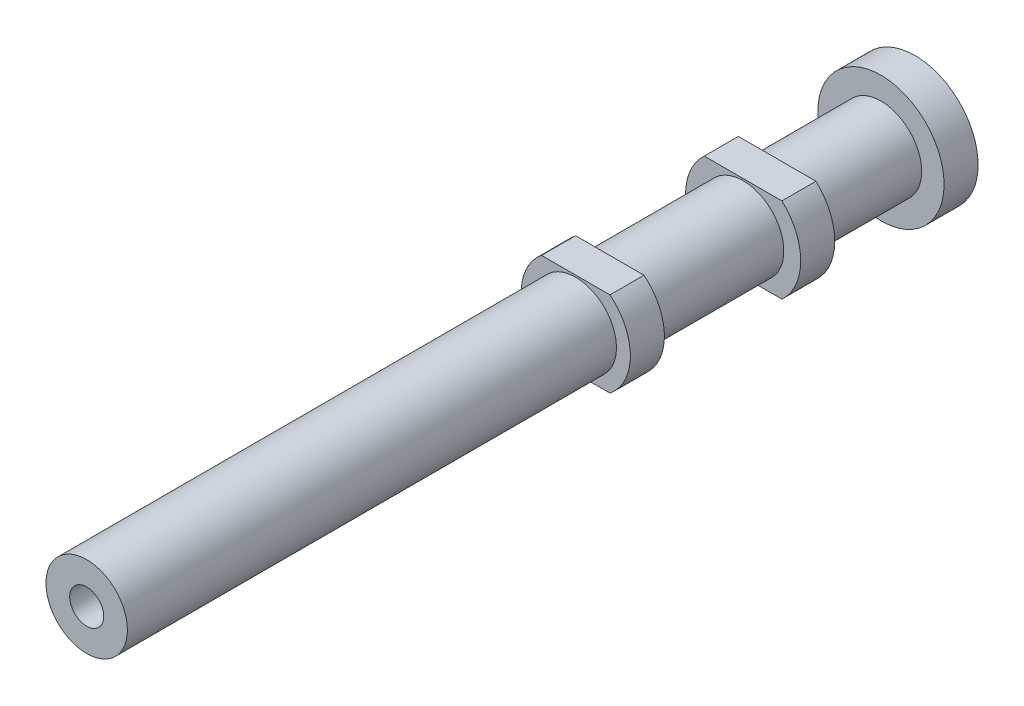
ISO-10303-21;
HEADER;
FILE_DESCRIPTION(('STEP AP214'),'2;1');
FILE_NAME('part.step','',(''),(''),'','','');
FILE_SCHEMA(('AUTOMOTIVE_DESIGN { 1 0 10303 214 1 1 1 1 }'));
ENDSEC;
DATA;
#1=APPLICATION_CONTEXT('core data for automotive mechanical design processes');
#2=APPLICATION_PROTOCOL_DEFINITION('international standard','automotive_design',2000,#1);
#3=PRODUCT_CONTEXT('',#1,'mechanical');
#4=PRODUCT('Part','Part','',(#3));
#5=PRODUCT_RELATED_PRODUCT_CATEGORY('part','',(#4));
#6=PRODUCT_DEFINITION_FORMATION('','',#4);
#7=PRODUCT_DEFINITION_CONTEXT('part definition',#1,'design');
#8=PRODUCT_DEFINITION('design','',#6,#7);
#9=PRODUCT_DEFINITION_SHAPE('','',#8);
#10=(LENGTH_UNIT() NAMED_UNIT(*) SI_UNIT(.MILLI.,.METRE.));
#11=(NAMED_UNIT(*) PLANE_ANGLE_UNIT() SI_UNIT($,.RADIAN.));
#12=(NAMED_UNIT(*) SI_UNIT($,.STERADIAN.) SOLID_ANGLE_UNIT());
#13=UNCERTAINTY_MEASURE_WITH_UNIT(LENGTH_MEASURE(1.E-05),#10,'distance_accuracy_value','');
#14=(GEOMETRIC_REPRESENTATION_CONTEXT(3) GLOBAL_UNCERTAINTY_ASSIGNED_CONTEXT((#13)) GLOBAL_UNIT_ASSIGNED_CONTEXT((#10,
#11,#12)) REPRESENTATION_CONTEXT('',''));
#15=CARTESIAN_POINT('',(0.,0.,0.));
#16=DIRECTION('',(0.,0.,1.));
#17=DIRECTION('',(1.,0.,0.));
#18=AXIS2_PLACEMENT_3D('',#15,#16,#17);
#19=CARTESIAN_POINT('',(0.,0.,-14.6));
#20=DIRECTION('',(0.,0.,-1.));
#21=DIRECTION('',(-1.,0.,0.));
#22=AXIS2_PLACEMENT_3D('',#19,#20,#21);
#23=CYLINDRICAL_SURFACE('',#22,1.925);
#24=CARTESIAN_POINT('',(0.,0.,-2.64));
#25=DIRECTION('',(0.,0.,-1.));
#26=DIRECTION('',(-1.,0.,0.));
#27=AXIS2_PLACEMENT_3D('',#24,#25,#26);
#28=CIRCLE('',#27,1.925);
#29=CARTESIAN_POINT('',(-1.20649285120139,-1.50000000000006,-2.64));
#30=VERTEX_POINT('',#29);
#31=CARTESIAN_POINT('',(-1.20649285120139,1.50000000000006,-2.64));
#32=VERTEX_POINT('',#31);
#33=EDGE_CURVE('E141',#30,#32,#28,.T.);
#34=ORIENTED_EDGE('',*,*,#33,.T.);
#35=DIRECTION('',(0.,0.,-1.));
#36=VECTOR('',#35,1.);
#37=CARTESIAN_POINT('',(-1.20649285120128,1.49999999999983,-14.6));
#38=LINE('',#37,#36);
#39=CARTESIAN_POINT('',(-1.20649285120139,1.50000000000006,-3.84));
#40=VERTEX_POINT('',#39);
#41=EDGE_CURVE('E67',#32,#40,#38,.T.);
#42=ORIENTED_EDGE('',*,*,#41,.T.);
#43=CARTESIAN_POINT('',(0.,0.,-3.84));
#44=DIRECTION('',(0.,0.,-1.));
#45=DIRECTION('',(-1.,0.,0.));
#46=AXIS2_PLACEMENT_3D('',#43,#44,#45);
#47=CIRCLE('',#46,1.925);
#48=CARTESIAN_POINT('',(-1.20649285120139,-1.50000000000006,-3.84));
#49=VERTEX_POINT('',#48);
#50=EDGE_CURVE('E151',#49,#40,#47,.T.);
#51=ORIENTED_EDGE('',*,*,#50,.F.);
#52=DIRECTION('',(0.,0.,-1.));
#53=VECTOR('',#52,1.);
#54=CARTESIAN_POINT('',(-1.20649285120139,-1.50000000000006,-14.6));
#55=LINE('',#54,#53);
#56=EDGE_CURVE('E295',#49,#30,#55,.F.);
#57=ORIENTED_EDGE('',*,*,#56,.T.);
#58=EDGE_LOOP('',(#34,#42,#51,#57));
#59=FACE_BOUND('',#58,.T.);
#60=ADVANCED_FACE('F43',(#59),#23,.T.);
#61=CARTESIAN_POINT('',(0.,0.,-14.6));
#62=DIRECTION('',(0.,0.,-1.));
#63=DIRECTION('',(-1.,0.,0.));
#64=AXIS2_PLACEMENT_3D('',#61,#62,#63);
#65=CYLINDRICAL_SURFACE('',#64,2.03);
#66=CARTESIAN_POINT('',(0.,0.,-8.54));
#67=DIRECTION('',(0.,0.,-1.));
#68=DIRECTION('',(-1.,0.,0.));
#69=AXIS2_PLACEMENT_3D('',#66,#67,#68);
#70=CIRCLE('',#69,2.03);
#71=CARTESIAN_POINT('',(-1.36780846612378,-1.50000000000028,-8.54));
#72=VERTEX_POINT('',#71);
#73=CARTESIAN_POINT('',(-1.36780846612383,1.49999999999983,-8.54000000000001));
#74=VERTEX_POINT('',#73);
#75=EDGE_CURVE('E143',#72,#74,#70,.T.);
#76=ORIENTED_EDGE('',*,*,#75,.T.);
#77=DIRECTION('',(0.,0.,-1.));
#78=VECTOR('',#77,1.);
#79=CARTESIAN_POINT('',(-1.36780846612378,1.49999999999983,-14.6));
#80=LINE('',#79,#78);
#81=CARTESIAN_POINT('',(-1.36780846612383,1.49999999999983,-9.74000000000001));
#82=VERTEX_POINT('',#81);
#83=EDGE_CURVE('E134',#74,#82,#80,.T.);
#84=ORIENTED_EDGE('',*,*,#83,.T.);
#85=CARTESIAN_POINT('',(0.,0.,-9.74));
#86=DIRECTION('',(0.,0.,-1.));
#87=DIRECTION('',(-1.,0.,0.));
#88=AXIS2_PLACEMENT_3D('',#85,#86,#87);
#89=CIRCLE('',#88,2.03);
#90=CARTESIAN_POINT('',(-1.36780846612378,-1.50000000000028,-9.74));
#91=VERTEX_POINT('',#90);
#92=EDGE_CURVE('E127',#91,#82,#89,.T.);
#93=ORIENTED_EDGE('',*,*,#92,.F.);
#94=DIRECTION('',(0.,0.,-1.));
#95=VECTOR('',#94,1.);
#96=CARTESIAN_POINT('',(-1.36780846612378,-1.50000000000028,-14.6));
#97=LINE('',#96,#95);
#98=EDGE_CURVE('E108',#91,#72,#97,.F.);
#99=ORIENTED_EDGE('',*,*,#98,.T.);
#100=EDGE_LOOP('',(#76,#84,#93,#99));
#101=FACE_BOUND('',#100,.T.);
#102=ADVANCED_FACE('F133',(#101),#65,.T.);
#103=CARTESIAN_POINT('',(0.,0.,14.6));
#104=DIRECTION('',(0.,0.,-1.));
#105=DIRECTION('',(-1.,0.,0.));
#106=AXIS2_PLACEMENT_3D('',#103,#104,#105);
#107=CYLINDRICAL_SURFACE('',#106,1.435);
#108=CARTESIAN_POINT('',(0.,0.,-9.74));
#109=DIRECTION('',(0.,0.,1.));
#110=DIRECTION('',(1.,0.,0.));
#111=AXIS2_PLACEMENT_3D('',#108,#109,#110);
#112=CIRCLE('',#111,1.435);
#113=CARTESIAN_POINT('',(1.435,0.,-9.74));
#114=VERTEX_POINT('',#113);
#115=EDGE_CURVE('E180',#114,#114,#112,.T.);
#116=ORIENTED_EDGE('',*,*,#115,.F.);
#117=EDGE_LOOP('',(#116));
#118=FACE_BOUND('',#117,.T.);
#119=CARTESIAN_POINT('',(0.,0.,-13.4));
#120=DIRECTION('',(0.,0.,-1.));
#121=DIRECTION('',(-1.,0.,0.));
#122=AXIS2_PLACEMENT_3D('',#119,#120,#121);
#123=CIRCLE('',#122,1.435);
#124=CARTESIAN_POINT('',(-1.435,0.,-13.4));
#125=VERTEX_POINT('',#124);
#126=EDGE_CURVE('E184',#125,#125,#123,.T.);
#127=ORIENTED_EDGE('',*,*,#126,.F.);
#128=EDGE_LOOP('',(#127));
#129=FACE_BOUND('',#128,.T.);
#130=ADVANCED_FACE('F45',(#118,#129),#107,.T.);
#131=CARTESIAN_POINT('',(0.,0.,-3.84));
#132=DIRECTION('',(0.,0.,1.));
#133=DIRECTION('',(1.,0.,0.));
#134=AXIS2_PLACEMENT_3D('',#131,#132,#133);
#135=CIRCLE('',#134,1.435);
#136=CARTESIAN_POINT('',(1.435,0.,-3.84));
#137=VERTEX_POINT('',#136);
#138=EDGE_CURVE('E172',#137,#137,#135,.T.);
#139=ORIENTED_EDGE('',*,*,#138,.F.);
#140=EDGE_LOOP('',(#139));
#141=FACE_BOUND('',#140,.T.);
#142=CARTESIAN_POINT('',(0.,0.,-8.54));
#143=DIRECTION('',(0.,0.,-1.));
#144=DIRECTION('',(-1.,0.,0.));
#145=AXIS2_PLACEMENT_3D('',#142,#143,#144);
#146=CIRCLE('',#145,1.435);
#147=CARTESIAN_POINT('',(-1.435,0.,-8.54));
#148=VERTEX_POINT('',#147);
#149=EDGE_CURVE('E176',#148,#148,#146,.T.);
#150=ORIENTED_EDGE('',*,*,#149,.F.);
#151=EDGE_LOOP('',(#150));
#152=FACE_BOUND('',#151,.T.);
#153=ADVANCED_FACE('F243',(#141,#152),#107,.T.);
#154=CARTESIAN_POINT('',(0.,0.,14.6));
#155=DIRECTION('',(0.,0.,1.));
#156=DIRECTION('',(1.,0.,0.));
#157=AXIS2_PLACEMENT_3D('',#154,#155,#156);
#158=CIRCLE('',#157,1.435);
#159=CARTESIAN_POINT('',(1.435,0.,14.6));
#160=VERTEX_POINT('',#159);
#161=EDGE_CURVE('E160',#160,#160,#158,.T.);
#162=ORIENTED_EDGE('',*,*,#161,.F.);
#163=EDGE_LOOP('',(#162));
#164=FACE_BOUND('',#163,.T.);
#165=CARTESIAN_POINT('',(0.,0.,-2.64));
#166=DIRECTION('',(0.,0.,-1.));
#167=DIRECTION('',(-1.,0.,0.));
#168=AXIS2_PLACEMENT_3D('',#165,#166,#167);
#169=CIRCLE('',#168,1.435);
#170=CARTESIAN_POINT('',(-1.435,0.,-2.64));
#171=VERTEX_POINT('',#170);
#172=EDGE_CURVE('E168',#171,#171,#169,.T.);
#173=ORIENTED_EDGE('',*,*,#172,.F.);
#174=EDGE_LOOP('',(#173));
#175=FACE_BOUND('',#174,.T.);
#176=ADVANCED_FACE('F245',(#164,#175),#107,.T.);
#177=CARTESIAN_POINT('',(0.,0.,14.6));
#178=DIRECTION('',(0.,0.,1.));
#179=DIRECTION('',(1.,0.,0.));
#180=AXIS2_PLACEMENT_3D('',#177,#178,#179);
#181=PLANE('',#180);
#182=CARTESIAN_POINT('',(0.,0.,14.6));
#183=DIRECTION('',(0.,0.,1.));
#184=DIRECTION('',(1.,0.,0.));
#185=AXIS2_PLACEMENT_3D('',#182,#183,#184);
#186=CIRCLE('',#185,0.6);
#187=CARTESIAN_POINT('',(0.6,0.,14.6));
#188=VERTEX_POINT('',#187);
#189=EDGE_CURVE('E161',#188,#188,#186,.T.);
#190=ORIENTED_EDGE('',*,*,#189,.F.);
#191=EDGE_LOOP('',(#190));
#192=FACE_BOUND('',#191,.T.);
#193=ORIENTED_EDGE('',*,*,#161,.T.);
#194=EDGE_LOOP('',(#193));
#195=FACE_BOUND('',#194,.T.);
#196=ADVANCED_FACE('F254',(#192,#195),#181,.T.);
#197=CARTESIAN_POINT('',(0.,0.,9.6));
#198=DIRECTION('',(0.,0.,1.));
#199=DIRECTION('',(1.,0.,0.));
#200=AXIS2_PLACEMENT_3D('',#197,#198,#199);
#201=CYLINDRICAL_SURFACE('',#200,0.6);
#202=CARTESIAN_POINT('',(0.,0.,9.6));
#203=DIRECTION('',(0.,0.,1.));
#204=DIRECTION('',(1.,0.,0.));
#205=AXIS2_PLACEMENT_3D('',#202,#203,#204);
#206=CIRCLE('',#205,0.6);
#207=CARTESIAN_POINT('',(0.6,0.,9.6));
#208=VERTEX_POINT('',#207);
#209=EDGE_CURVE('E156',#208,#208,#206,.T.);
#210=ORIENTED_EDGE('',*,*,#209,.F.);
#211=EDGE_LOOP('',(#210));
#212=FACE_BOUND('',#211,.T.);
#213=ORIENTED_EDGE('',*,*,#189,.T.);
#214=EDGE_LOOP('',(#213));
#215=FACE_BOUND('',#214,.T.);
#216=ADVANCED_FACE('F274',(#212,#215),#201,.F.);
#217=CARTESIAN_POINT('',(0.,0.,9.6));
#218=DIRECTION('',(0.,0.,1.));
#219=DIRECTION('',(1.,0.,0.));
#220=AXIS2_PLACEMENT_3D('',#217,#218,#219);
#221=PLANE('',#220);
#222=ORIENTED_EDGE('',*,*,#209,.T.);
#223=EDGE_LOOP('',(#222));
#224=FACE_BOUND('',#223,.T.);
#225=ADVANCED_FACE('F266',(#224),#221,.T.);
#226=CARTESIAN_POINT('',(1.2064928512015,1.49999999999895,-3.84));
#227=VERTEX_POINT('',#226);
#228=CARTESIAN_POINT('',(1.20649285120145,-1.50000000000006,-3.84));
#229=VERTEX_POINT('',#228);
#230=EDGE_CURVE('E155',#227,#229,#47,.T.);
#231=ORIENTED_EDGE('',*,*,#230,.F.);
#232=DIRECTION('',(0.,0.,-1.));
#233=VECTOR('',#232,1.);
#234=CARTESIAN_POINT('',(1.2064928512015,1.49999999999895,-14.6));
#235=LINE('',#234,#233);
#236=CARTESIAN_POINT('',(1.2064928512015,1.49999999999895,-2.64));
#237=VERTEX_POINT('',#236);
#238=EDGE_CURVE('E212',#227,#237,#235,.F.);
#239=ORIENTED_EDGE('',*,*,#238,.T.);
#240=CARTESIAN_POINT('',(1.20649285120145,-1.50000000000006,-2.64));
#241=VERTEX_POINT('',#240);
#242=EDGE_CURVE('E150',#237,#241,#28,.T.);
#243=ORIENTED_EDGE('',*,*,#242,.T.);
#244=DIRECTION('',(0.,0.,-1.));
#245=VECTOR('',#244,1.);
#246=CARTESIAN_POINT('',(1.20649285120145,-1.50000000000006,-14.6));
#247=LINE('',#246,#245);
#248=EDGE_CURVE('E59',#241,#229,#247,.T.);
#249=ORIENTED_EDGE('',*,*,#248,.T.);
#250=EDGE_LOOP('',(#231,#239,#243,#249));
#251=FACE_BOUND('',#250,.T.);
#252=ADVANCED_FACE('F259',(#251),#23,.T.);
#253=CARTESIAN_POINT('',(1.43500000000002,0.,-3.84));
#254=DIRECTION('',(0.,0.,1.));
#255=DIRECTION('',(1.,0.,0.));
#256=AXIS2_PLACEMENT_3D('',#253,#254,#255);
#257=PLANE('',#256);
#258=ORIENTED_EDGE('',*,*,#138,.T.);
#259=EDGE_LOOP('',(#258));
#260=FACE_BOUND('',#259,.T.);
#261=ORIENTED_EDGE('',*,*,#50,.T.);
#262=DIRECTION('',(1.,0.,0.));
#263=VECTOR('',#262,1.);
#264=CARTESIAN_POINT('',(1.43500000000019,1.49999999999895,-3.84));
#265=LINE('',#264,#263);
#266=EDGE_CURVE('E218',#40,#227,#265,.T.);
#267=ORIENTED_EDGE('',*,*,#266,.T.);
#268=ORIENTED_EDGE('',*,*,#230,.T.);
#269=DIRECTION('',(-1.,0.,0.));
#270=VECTOR('',#269,1.);
#271=CARTESIAN_POINT('',(1.43500000000002,-1.50000000000006,-3.84));
#272=LINE('',#271,#270);
#273=EDGE_CURVE('E199',#229,#49,#272,.T.);
#274=ORIENTED_EDGE('',*,*,#273,.T.);
#275=EDGE_LOOP('',(#261,#267,#268,#274));
#276=FACE_BOUND('',#275,.T.);
#277=ADVANCED_FACE('F265',(#260,#276),#257,.F.);
#278=CARTESIAN_POINT('',(1.43500000000002,0.,-2.64));
#279=DIRECTION('',(0.,0.,-1.));
#280=DIRECTION('',(-1.,0.,0.));
#281=AXIS2_PLACEMENT_3D('',#278,#279,#280);
#282=PLANE('',#281);
#283=ORIENTED_EDGE('',*,*,#242,.F.);
#284=DIRECTION('',(-1.,0.,0.));
#285=VECTOR('',#284,1.);
#286=CARTESIAN_POINT('',(1.43500000000019,1.49999999999895,-2.64));
#287=LINE('',#286,#285);
#288=EDGE_CURVE('E204',#237,#32,#287,.T.);
#289=ORIENTED_EDGE('',*,*,#288,.T.);
#290=ORIENTED_EDGE('',*,*,#33,.F.);
#291=DIRECTION('',(1.,0.,0.));
#292=VECTOR('',#291,1.);
#293=CARTESIAN_POINT('',(1.43500000000002,-1.50000000000006,-2.64));
#294=LINE('',#293,#292);
#295=EDGE_CURVE('E292',#30,#241,#294,.T.);
#296=ORIENTED_EDGE('',*,*,#295,.T.);
#297=EDGE_LOOP('',(#283,#289,#290,#296));
#298=FACE_BOUND('',#297,.T.);
#299=ORIENTED_EDGE('',*,*,#172,.T.);
#300=EDGE_LOOP('',(#299));
#301=FACE_BOUND('',#300,.T.);
#302=ADVANCED_FACE('F272',(#298,#301),#282,.F.);
#303=CARTESIAN_POINT('',(1.36780846612394,1.49999999999895,-9.74));
#304=VERTEX_POINT('',#303);
#305=CARTESIAN_POINT('',(1.36780846612389,-1.50000000000072,-9.74));
#306=VERTEX_POINT('',#305);
#307=EDGE_CURVE('E129',#304,#306,#89,.T.);
#308=ORIENTED_EDGE('',*,*,#307,.F.);
#309=DIRECTION('',(0.,0.,-1.));
#310=VECTOR('',#309,1.);
#311=CARTESIAN_POINT('',(1.36780846612394,1.49999999999895,-14.6));
#312=LINE('',#311,#310);
#313=CARTESIAN_POINT('',(1.36780846612394,1.49999999999895,-8.54));
#314=VERTEX_POINT('',#313);
#315=EDGE_CURVE('E196',#304,#314,#312,.F.);
#316=ORIENTED_EDGE('',*,*,#315,.T.);
#317=CARTESIAN_POINT('',(1.36780846612389,-1.50000000000072,-8.54));
#318=VERTEX_POINT('',#317);
#319=EDGE_CURVE('E136',#314,#318,#70,.T.);
#320=ORIENTED_EDGE('',*,*,#319,.T.);
#321=DIRECTION('',(0.,0.,-1.));
#322=VECTOR('',#321,1.);
#323=CARTESIAN_POINT('',(1.36780846612389,-1.50000000000072,-14.6));
#324=LINE('',#323,#322);
#325=EDGE_CURVE('E119',#318,#306,#324,.T.);
#326=ORIENTED_EDGE('',*,*,#325,.T.);
#327=EDGE_LOOP('',(#308,#316,#320,#326));
#328=FACE_BOUND('',#327,.T.);
#329=ADVANCED_FACE('F195',(#328),#65,.T.);
#330=CARTESIAN_POINT('',(1.43500000000002,0.,-9.74));
#331=DIRECTION('',(0.,0.,1.));
#332=DIRECTION('',(1.,0.,0.));
#333=AXIS2_PLACEMENT_3D('',#330,#331,#332);
#334=PLANE('',#333);
#335=ORIENTED_EDGE('',*,*,#115,.T.);
#336=EDGE_LOOP('',(#335));
#337=FACE_BOUND('',#336,.T.);
#338=ORIENTED_EDGE('',*,*,#92,.T.);
#339=DIRECTION('',(-1.,0.,0.));
#340=VECTOR('',#339,1.);
#341=CARTESIAN_POINT('',(-1.99999999999995,1.49999999999939,-9.74));
#342=LINE('',#341,#340);
#343=EDGE_CURVE('E120',#304,#82,#342,.T.);
#344=ORIENTED_EDGE('',*,*,#343,.F.);
#345=ORIENTED_EDGE('',*,*,#307,.T.);
#346=DIRECTION('',(1.,0.,0.));
#347=VECTOR('',#346,1.);
#348=CARTESIAN_POINT('',(-1.99999999999995,-1.5000000000005,-9.74));
#349=LINE('',#348,#347);
#350=EDGE_CURVE('E111',#91,#306,#349,.T.);
#351=ORIENTED_EDGE('',*,*,#350,.F.);
#352=EDGE_LOOP('',(#338,#344,#345,#351));
#353=FACE_BOUND('',#352,.T.);
#354=ADVANCED_FACE('F125',(#337,#353),#334,.F.);
#355=CARTESIAN_POINT('',(1.43500000000002,0.,-8.54));
#356=DIRECTION('',(0.,0.,-1.));
#357=DIRECTION('',(-1.,0.,0.));
#358=AXIS2_PLACEMENT_3D('',#355,#356,#357);
#359=PLANE('',#358);
#360=ORIENTED_EDGE('',*,*,#319,.F.);
#361=DIRECTION('',(-1.,0.,0.));
#362=VECTOR('',#361,1.);
#363=CARTESIAN_POINT('',(1.43500000000019,1.49999999999895,-8.54000000000001));
#364=LINE('',#363,#362);
#365=EDGE_CURVE('E11',#314,#74,#364,.T.);
#366=ORIENTED_EDGE('',*,*,#365,.T.);
#367=ORIENTED_EDGE('',*,*,#75,.F.);
#368=DIRECTION('',(1.,0.,0.));
#369=VECTOR('',#368,1.);
#370=CARTESIAN_POINT('',(1.43500000000008,-1.50000000000006,-8.54));
#371=LINE('',#370,#369);
#372=EDGE_CURVE('E52',#72,#318,#371,.T.);
#373=ORIENTED_EDGE('',*,*,#372,.T.);
#374=EDGE_LOOP('',(#360,#366,#367,#373));
#375=FACE_BOUND('',#374,.T.);
#376=ORIENTED_EDGE('',*,*,#149,.T.);
#377=EDGE_LOOP('',(#376));
#378=FACE_BOUND('',#377,.T.);
#379=ADVANCED_FACE('F191',(#375,#378),#359,.F.);
#380=CARTESIAN_POINT('',(1.43500000000002,0.,-13.4));
#381=DIRECTION('',(0.,0.,-1.));
#382=DIRECTION('',(-1.,0.,0.));
#383=AXIS2_PLACEMENT_3D('',#380,#381,#382);
#384=PLANE('',#383);
#385=CARTESIAN_POINT('',(0.,0.,-13.4));
#386=DIRECTION('',(0.,0.,-1.));
#387=DIRECTION('',(-1.,0.,0.));
#388=AXIS2_PLACEMENT_3D('',#385,#386,#387);
#389=CIRCLE('',#388,2.225);
#390=CARTESIAN_POINT('',(-2.225,0.,-13.4));
#391=VERTEX_POINT('',#390);
#392=EDGE_CURVE('E225',#391,#391,#389,.T.);
#393=ORIENTED_EDGE('',*,*,#392,.F.);
#394=EDGE_LOOP('',(#393));
#395=FACE_BOUND('',#394,.T.);
#396=ORIENTED_EDGE('',*,*,#126,.T.);
#397=EDGE_LOOP('',(#396));
#398=FACE_BOUND('',#397,.T.);
#399=ADVANCED_FACE('F236',(#395,#398),#384,.F.);
#400=CARTESIAN_POINT('',(0.,0.,-14.6));
#401=DIRECTION('',(0.,0.,-1.));
#402=DIRECTION('',(-1.,0.,0.));
#403=AXIS2_PLACEMENT_3D('',#400,#401,#402);
#404=CYLINDRICAL_SURFACE('',#403,2.225);
#405=CARTESIAN_POINT('',(0.,0.,-14.6));
#406=DIRECTION('',(0.,0.,-1.));
#407=DIRECTION('',(-1.,0.,0.));
#408=AXIS2_PLACEMENT_3D('',#405,#406,#407);
#409=CIRCLE('',#408,2.225);
#410=CARTESIAN_POINT('',(-2.225,0.,-14.6));
#411=VERTEX_POINT('',#410);
#412=EDGE_CURVE('E222',#411,#411,#409,.T.);
#413=ORIENTED_EDGE('',*,*,#412,.F.);
#414=EDGE_LOOP('',(#413));
#415=FACE_BOUND('',#414,.T.);
#416=ORIENTED_EDGE('',*,*,#392,.T.);
#417=EDGE_LOOP('',(#416));
#418=FACE_BOUND('',#417,.T.);
#419=ADVANCED_FACE('F234',(#415,#418),#404,.T.);
#420=CARTESIAN_POINT('',(0.,0.,-14.6));
#421=DIRECTION('',(0.,0.,1.));
#422=DIRECTION('',(1.,0.,0.));
#423=AXIS2_PLACEMENT_3D('',#420,#421,#422);
#424=PLANE('',#423);
#425=ORIENTED_EDGE('',*,*,#412,.T.);
#426=EDGE_LOOP('',(#425));
#427=FACE_BOUND('',#426,.T.);
#428=ADVANCED_FACE('F319',(#427),#424,.F.);
#429=CARTESIAN_POINT('',(-1.99999999999995,-1.5000000000005,-13.8631056256177));
#430=DIRECTION('',(0.,1.,0.));
#431=DIRECTION('',(0.,0.,1.));
#432=AXIS2_PLACEMENT_3D('',#429,#430,#431);
#433=PLANE('',#432);
#434=ORIENTED_EDGE('',*,*,#372,.F.);
#435=ORIENTED_EDGE('',*,*,#98,.F.);
#436=ORIENTED_EDGE('',*,*,#350,.T.);
#437=ORIENTED_EDGE('',*,*,#325,.F.);
#438=EDGE_LOOP('',(#434,#435,#436,#437));
#439=FACE_BOUND('',#438,.T.);
#440=ADVANCED_FACE('F110',(#439),#433,.F.);
#441=CARTESIAN_POINT('',(-1.99999999999995,1.49999999999939,-13.8631056256177));
#442=DIRECTION('',(0.,-1.,0.));
#443=DIRECTION('',(1.,0.,0.));
#444=AXIS2_PLACEMENT_3D('',#441,#442,#443);
#445=PLANE('',#444);
#446=ORIENTED_EDGE('',*,*,#365,.F.);
#447=ORIENTED_EDGE('',*,*,#315,.F.);
#448=ORIENTED_EDGE('',*,*,#343,.T.);
#449=ORIENTED_EDGE('',*,*,#83,.F.);
#450=EDGE_LOOP('',(#446,#447,#448,#449));
#451=FACE_BOUND('',#450,.T.);
#452=ADVANCED_FACE('F309',(#451),#445,.F.);
#453=ORIENTED_EDGE('',*,*,#248,.F.);
#454=ORIENTED_EDGE('',*,*,#295,.F.);
#455=ORIENTED_EDGE('',*,*,#56,.F.);
#456=ORIENTED_EDGE('',*,*,#273,.F.);
#457=EDGE_LOOP('',(#453,#454,#455,#456));
#458=FACE_BOUND('',#457,.T.);
#459=ADVANCED_FACE('F311',(#458),#433,.F.);
#460=ORIENTED_EDGE('',*,*,#41,.F.);
#461=ORIENTED_EDGE('',*,*,#288,.F.);
#462=ORIENTED_EDGE('',*,*,#238,.F.);
#463=ORIENTED_EDGE('',*,*,#266,.F.);
#464=EDGE_LOOP('',(#460,#461,#462,#463));
#465=FACE_BOUND('',#464,.T.);
#466=ADVANCED_FACE('F313',(#465),#445,.F.);
#467=CLOSED_SHELL('',(#60,#102,#130,#153,#176,#196,#216,#225,#252,#277,#302,#329,#354,#379,#399,
#419,#428,#440,#452,#459,#466));
#468=MANIFOLD_SOLID_BREP('B2',#467);
#469=ADVANCED_BREP_SHAPE_REPRESENTATION('',(#18,#468),#14);
#470=SHAPE_DEFINITION_REPRESENTATION(#9,#469);
ENDSEC;
END-ISO-10303-21;
